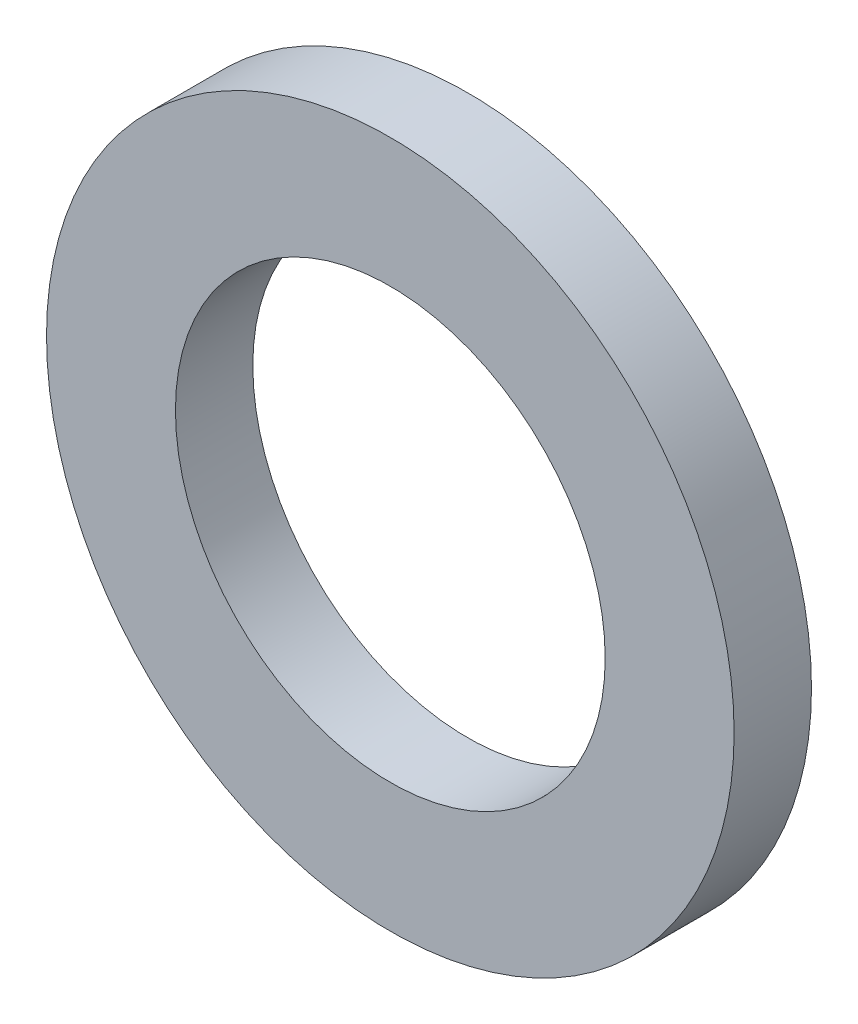
ISO-10303-21;
HEADER;
FILE_DESCRIPTION(('STEP AP214'),'2;1');
FILE_NAME('part.step','',(''),(''),'','','');
FILE_SCHEMA(('AUTOMOTIVE_DESIGN { 1 0 10303 214 1 1 1 1 }'));
ENDSEC;
DATA;
#1=APPLICATION_CONTEXT('core data for automotive mechanical design processes');
#2=APPLICATION_PROTOCOL_DEFINITION('international standard','automotive_design',2000,#1);
#3=PRODUCT_CONTEXT('',#1,'mechanical');
#4=PRODUCT('Part','Part','',(#3));
#5=PRODUCT_RELATED_PRODUCT_CATEGORY('part','',(#4));
#6=PRODUCT_DEFINITION_FORMATION('','',#4);
#7=PRODUCT_DEFINITION_CONTEXT('part definition',#1,'design');
#8=PRODUCT_DEFINITION('design','',#6,#7);
#9=PRODUCT_DEFINITION_SHAPE('','',#8);
#10=(LENGTH_UNIT() NAMED_UNIT(*) SI_UNIT(.MILLI.,.METRE.));
#11=(NAMED_UNIT(*) PLANE_ANGLE_UNIT() SI_UNIT($,.RADIAN.));
#12=(NAMED_UNIT(*) SI_UNIT($,.STERADIAN.) SOLID_ANGLE_UNIT());
#13=UNCERTAINTY_MEASURE_WITH_UNIT(LENGTH_MEASURE(1.E-05),#10,'distance_accuracy_value','');
#14=(GEOMETRIC_REPRESENTATION_CONTEXT(3) GLOBAL_UNCERTAINTY_ASSIGNED_CONTEXT((#13)) GLOBAL_UNIT_ASSIGNED_CONTEXT((#10,
#11,#12)) REPRESENTATION_CONTEXT('',''));
#15=CARTESIAN_POINT('',(0.,0.,0.));
#16=DIRECTION('',(0.,0.,1.));
#17=DIRECTION('',(1.,0.,0.));
#18=AXIS2_PLACEMENT_3D('',#15,#16,#17);
#19=CARTESIAN_POINT('',(0.,0.,1.35));
#20=DIRECTION('',(0.,0.,1.));
#21=DIRECTION('',(1.,0.,0.));
#22=AXIS2_PLACEMENT_3D('',#19,#20,#21);
#23=PLANE('',#22);
#24=CARTESIAN_POINT('',(0.,0.,1.35));
#25=DIRECTION('',(0.,0.,1.));
#26=DIRECTION('',(1.,0.,0.));
#27=AXIS2_PLACEMENT_3D('',#24,#25,#26);
#28=CIRCLE('',#27,12.);
#29=CARTESIAN_POINT('',(12.,0.,1.35));
#30=VERTEX_POINT('',#29);
#31=EDGE_CURVE('E10',#30,#30,#28,.T.);
#32=ORIENTED_EDGE('',*,*,#31,.T.);
#33=EDGE_LOOP('',(#32));
#34=FACE_BOUND('',#33,.T.);
#35=CARTESIAN_POINT('',(0.,0.,1.35));
#36=DIRECTION('',(0.,0.,1.));
#37=DIRECTION('',(1.,0.,0.));
#38=AXIS2_PLACEMENT_3D('',#35,#36,#37);
#39=CIRCLE('',#38,7.5);
#40=CARTESIAN_POINT('',(7.5,0.,1.35));
#41=VERTEX_POINT('',#40);
#42=EDGE_CURVE('E35',#41,#41,#39,.T.);
#43=ORIENTED_EDGE('',*,*,#42,.F.);
#44=EDGE_LOOP('',(#43));
#45=FACE_BOUND('',#44,.T.);
#46=ADVANCED_FACE('F28',(#34,#45),#23,.T.);
#47=CARTESIAN_POINT('',(0.,0.,1.35));
#48=DIRECTION('',(0.,0.,-1.));
#49=DIRECTION('',(-1.,0.,0.));
#50=AXIS2_PLACEMENT_3D('',#47,#48,#49);
#51=CYLINDRICAL_SURFACE('',#50,12.);
#52=ORIENTED_EDGE('',*,*,#31,.F.);
#53=EDGE_LOOP('',(#52));
#54=FACE_BOUND('',#53,.T.);
#55=CARTESIAN_POINT('',(0.,0.,-1.35));
#56=DIRECTION('',(0.,0.,1.));
#57=DIRECTION('',(1.,0.,0.));
#58=AXIS2_PLACEMENT_3D('',#55,#56,#57);
#59=CIRCLE('',#58,12.);
#60=CARTESIAN_POINT('',(12.,0.,-1.35));
#61=VERTEX_POINT('',#60);
#62=EDGE_CURVE('E39',#61,#61,#59,.T.);
#63=ORIENTED_EDGE('',*,*,#62,.T.);
#64=EDGE_LOOP('',(#63));
#65=FACE_BOUND('',#64,.T.);
#66=ADVANCED_FACE('F30',(#54,#65),#51,.T.);
#67=CARTESIAN_POINT('',(0.,0.,1.35));
#68=DIRECTION('',(0.,0.,-1.));
#69=DIRECTION('',(-1.,0.,0.));
#70=AXIS2_PLACEMENT_3D('',#67,#68,#69);
#71=CYLINDRICAL_SURFACE('',#70,7.5);
#72=ORIENTED_EDGE('',*,*,#42,.T.);
#73=EDGE_LOOP('',(#72));
#74=FACE_BOUND('',#73,.T.);
#75=CARTESIAN_POINT('',(0.,0.,-1.35));
#76=DIRECTION('',(0.,0.,1.));
#77=DIRECTION('',(1.,0.,0.));
#78=AXIS2_PLACEMENT_3D('',#75,#76,#77);
#79=CIRCLE('',#78,7.5);
#80=CARTESIAN_POINT('',(7.5,0.,-1.35));
#81=VERTEX_POINT('',#80);
#82=EDGE_CURVE('E43',#81,#81,#79,.T.);
#83=ORIENTED_EDGE('',*,*,#82,.F.);
#84=EDGE_LOOP('',(#83));
#85=FACE_BOUND('',#84,.T.);
#86=ADVANCED_FACE('F52',(#74,#85),#71,.F.);
#87=CARTESIAN_POINT('',(0.,0.,-1.35));
#88=DIRECTION('',(0.,0.,1.));
#89=DIRECTION('',(1.,0.,0.));
#90=AXIS2_PLACEMENT_3D('',#87,#88,#89);
#91=PLANE('',#90);
#92=ORIENTED_EDGE('',*,*,#82,.T.);
#93=EDGE_LOOP('',(#92));
#94=FACE_BOUND('',#93,.T.);
#95=ORIENTED_EDGE('',*,*,#62,.F.);
#96=EDGE_LOOP('',(#95));
#97=FACE_BOUND('',#96,.T.);
#98=ADVANCED_FACE('F49',(#94,#97),#91,.F.);
#99=CLOSED_SHELL('',(#46,#66,#86,#98));
#100=MANIFOLD_SOLID_BREP('B2',#99);
#101=ADVANCED_BREP_SHAPE_REPRESENTATION('',(#18,#100),#14);
#102=SHAPE_DEFINITION_REPRESENTATION(#9,#101);
ENDSEC;
END-ISO-10303-21;
